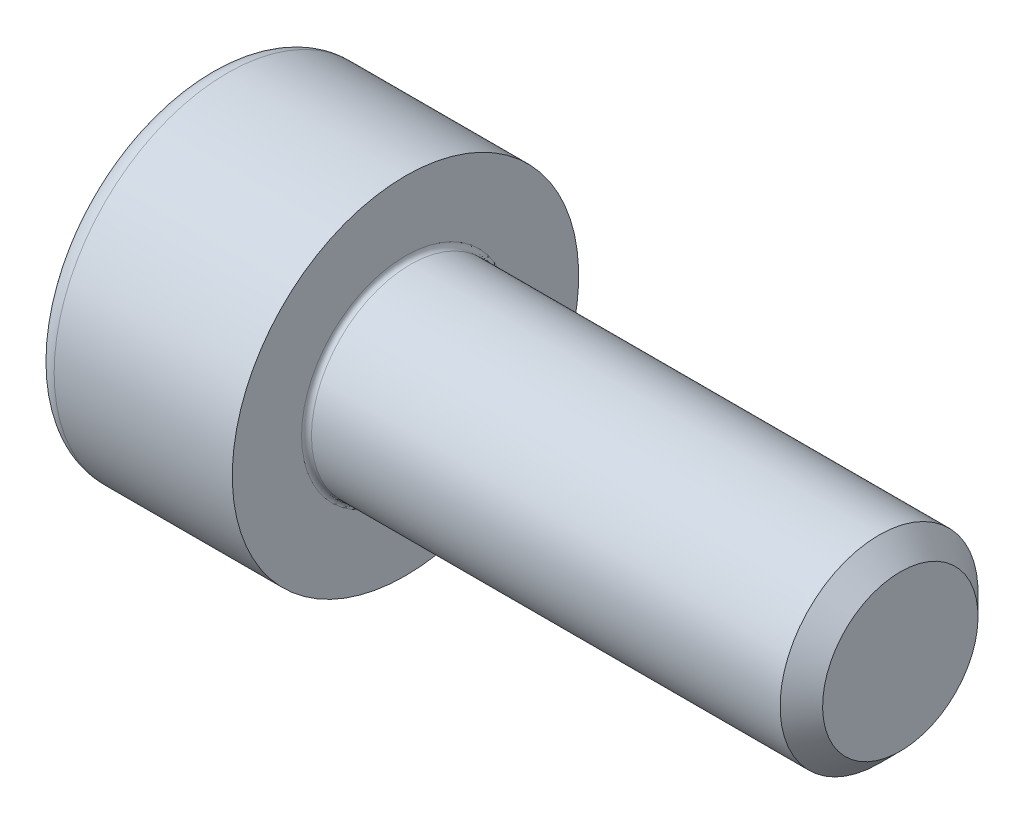
ISO-10303-21;
HEADER;
FILE_DESCRIPTION(('STEP AP214'),'2;1');
FILE_NAME('part.step','',(''),(''),'','','');
FILE_SCHEMA(('AUTOMOTIVE_DESIGN { 1 0 10303 214 1 1 1 1 }'));
ENDSEC;
DATA;
#1=APPLICATION_CONTEXT('core data for automotive mechanical design processes');
#2=APPLICATION_PROTOCOL_DEFINITION('international standard','automotive_design',2000,#1);
#3=PRODUCT_CONTEXT('',#1,'mechanical');
#4=PRODUCT('Part','Part','',(#3));
#5=PRODUCT_RELATED_PRODUCT_CATEGORY('part','',(#4));
#6=PRODUCT_DEFINITION_FORMATION('','',#4);
#7=PRODUCT_DEFINITION_CONTEXT('part definition',#1,'design');
#8=PRODUCT_DEFINITION('design','',#6,#7);
#9=PRODUCT_DEFINITION_SHAPE('','',#8);
#10=(LENGTH_UNIT() NAMED_UNIT(*) SI_UNIT(.MILLI.,.METRE.));
#11=(NAMED_UNIT(*) PLANE_ANGLE_UNIT() SI_UNIT($,.RADIAN.));
#12=(NAMED_UNIT(*) SI_UNIT($,.STERADIAN.) SOLID_ANGLE_UNIT());
#13=UNCERTAINTY_MEASURE_WITH_UNIT(LENGTH_MEASURE(1.E-05),#10,'distance_accuracy_value','');
#14=(GEOMETRIC_REPRESENTATION_CONTEXT(3) GLOBAL_UNCERTAINTY_ASSIGNED_CONTEXT((#13)) GLOBAL_UNIT_ASSIGNED_CONTEXT((#10,
#11,#12)) REPRESENTATION_CONTEXT('',''));
#15=CARTESIAN_POINT('',(0.,0.,0.));
#16=DIRECTION('',(0.,0.,1.));
#17=DIRECTION('',(1.,0.,0.));
#18=AXIS2_PLACEMENT_3D('',#15,#16,#17);
#19=CARTESIAN_POINT('',(-1.5,0.,0.));
#20=DIRECTION('',(-1.,0.,0.));
#21=DIRECTION('',(0.,1.,0.));
#22=AXIS2_PLACEMENT_3D('',#19,#20,#21);
#23=CONICAL_SURFACE('',#22,0.866025403784439,1.0471975511966);
#24=DIRECTION('',(-0.5,-0.866025403784439,0.));
#25=VECTOR('',#24,1.);
#26=CARTESIAN_POINT('',(-1.5,-0.866025403784439,0.));
#27=LINE('',#26,#25);
#28=CARTESIAN_POINT('',(-1.,0.,0.));
#29=VERTEX_POINT('',#28);
#30=CARTESIAN_POINT('',(-1.86602540378443,-1.5,0.));
#31=VERTEX_POINT('',#30);
#32=EDGE_CURVE('E12',#29,#31,#27,.T.);
#33=ORIENTED_EDGE('',*,*,#32,.T.);
#34=CARTESIAN_POINT('',(-1.86602540378443,-1.5,0.));
#35=CARTESIAN_POINT('',(-1.86602540378443,-1.5,0.401923788646684));
#36=CARTESIAN_POINT('',(-2.,-1.5,0.866025403784438));
#37=(BOUNDED_CURVE() B_SPLINE_CURVE(2,(#34,#35,#36),.UNSPECIFIED.,.F.,
.F.) B_SPLINE_CURVE_WITH_KNOTS((3,3),(0.0876327103558437,0.175265420711687),
.UNSPECIFIED.) CURVE() GEOMETRIC_REPRESENTATION_ITEM() RATIONAL_B_SPLINE_CURVE((1.07735026918962,
1.07735026918962,1.)) REPRESENTATION_ITEM(''));
#38=CARTESIAN_POINT('',(-2.,-1.5,0.866025403784438));
#39=VERTEX_POINT('',#38);
#40=EDGE_CURVE('E193',#31,#39,#37,.T.);
#41=ORIENTED_EDGE('',*,*,#40,.T.);
#42=CARTESIAN_POINT('',(-2.,-1.5,0.86602540378444));
#43=CARTESIAN_POINT('',(-1.75,-0.750000000000001,1.29903810567666));
#44=CARTESIAN_POINT('',(-2.,0.,1.73205080756888));
#45=(BOUNDED_CURVE() B_SPLINE_CURVE(2,(#42,#43,#44),.UNSPECIFIED.,.F.,
.F.) B_SPLINE_CURVE_WITH_KNOTS((3,3),(0.,0.175265420711687),
.UNSPECIFIED.) CURVE() GEOMETRIC_REPRESENTATION_ITEM() RATIONAL_B_SPLINE_CURVE((1.,
1.15470053837925,1.)) REPRESENTATION_ITEM(''));
#46=CARTESIAN_POINT('',(-2.,0.,1.73205080756888));
#47=VERTEX_POINT('',#46);
#48=EDGE_CURVE('E52',#39,#47,#45,.T.);
#49=ORIENTED_EDGE('',*,*,#48,.T.);
#50=CARTESIAN_POINT('',(-2.,0.,1.73205080756888));
#51=CARTESIAN_POINT('',(-1.74999999999999,0.750000000000001,1.29903810567666));
#52=CARTESIAN_POINT('',(-2.,1.5,0.866025403784438));
#53=(BOUNDED_CURVE() B_SPLINE_CURVE(2,(#50,#51,#52),.UNSPECIFIED.,.F.,
.F.) B_SPLINE_CURVE_WITH_KNOTS((3,3),(0.,0.175265420711688),
.UNSPECIFIED.) CURVE() GEOMETRIC_REPRESENTATION_ITEM() RATIONAL_B_SPLINE_CURVE((1.,
1.15470053837925,1.)) REPRESENTATION_ITEM(''));
#54=CARTESIAN_POINT('',(-2.,1.5,0.866025403784438));
#55=VERTEX_POINT('',#54);
#56=EDGE_CURVE('E183',#47,#55,#53,.T.);
#57=ORIENTED_EDGE('',*,*,#56,.T.);
#58=CARTESIAN_POINT('',(-2.,1.5,0.866025403784436));
#59=CARTESIAN_POINT('',(-1.75,1.5,0.));
#60=CARTESIAN_POINT('',(-2.,1.5,-0.866025403784437));
#61=(BOUNDED_CURVE() B_SPLINE_CURVE(2,(#58,#59,#60),.UNSPECIFIED.,.F.,
.F.) B_SPLINE_CURVE_WITH_KNOTS((3,3),(0.,0.175265420711687),
.UNSPECIFIED.) CURVE() GEOMETRIC_REPRESENTATION_ITEM() RATIONAL_B_SPLINE_CURVE((1.,
1.15470053837925,1.)) REPRESENTATION_ITEM(''));
#62=CARTESIAN_POINT('',(-2.,1.5,-0.866025403784439));
#63=VERTEX_POINT('',#62);
#64=EDGE_CURVE('E184',#55,#63,#61,.T.);
#65=ORIENTED_EDGE('',*,*,#64,.T.);
#66=CARTESIAN_POINT('',(-2.,1.5,-0.86602540378444));
#67=CARTESIAN_POINT('',(-1.75,0.750000000000001,-1.29903810567666));
#68=CARTESIAN_POINT('',(-2.,0.,-1.73205080756888));
#69=(BOUNDED_CURVE() B_SPLINE_CURVE(2,(#66,#67,#68),.UNSPECIFIED.,.F.,
.F.) B_SPLINE_CURVE_WITH_KNOTS((3,3),(0.,0.175265420711687),
.UNSPECIFIED.) CURVE() GEOMETRIC_REPRESENTATION_ITEM() RATIONAL_B_SPLINE_CURVE((1.,
1.15470053837925,1.)) REPRESENTATION_ITEM(''));
#70=CARTESIAN_POINT('',(-2.,0.,-1.73205080756888));
#71=VERTEX_POINT('',#70);
#72=EDGE_CURVE('E150',#63,#71,#69,.T.);
#73=ORIENTED_EDGE('',*,*,#72,.T.);
#74=CARTESIAN_POINT('',(-2.,0.,-1.73205080756888));
#75=CARTESIAN_POINT('',(-1.74999999999999,-0.750000000000001,-1.29903810567666));
#76=CARTESIAN_POINT('',(-2.,-1.5,-0.866025403784439));
#77=(BOUNDED_CURVE() B_SPLINE_CURVE(2,(#74,#75,#76),.UNSPECIFIED.,.F.,
.F.) B_SPLINE_CURVE_WITH_KNOTS((3,3),(0.,0.175265420711688),
.UNSPECIFIED.) CURVE() GEOMETRIC_REPRESENTATION_ITEM() RATIONAL_B_SPLINE_CURVE((1.,
1.15470053837925,1.)) REPRESENTATION_ITEM(''));
#78=CARTESIAN_POINT('',(-2.,-1.5,-0.866025403784438));
#79=VERTEX_POINT('',#78);
#80=EDGE_CURVE('E222',#71,#79,#77,.T.);
#81=ORIENTED_EDGE('',*,*,#80,.T.);
#82=CARTESIAN_POINT('',(-2.,-1.5,-0.866025403784437));
#83=CARTESIAN_POINT('',(-1.86602540378443,-1.5,-0.401923788646684));
#84=CARTESIAN_POINT('',(-1.86602540378443,-1.5,0.));
#85=(BOUNDED_CURVE() B_SPLINE_CURVE(2,(#82,#83,#84),.UNSPECIFIED.,.F.,
.F.) B_SPLINE_CURVE_WITH_KNOTS((3,3),(0.,0.0876327103558437),
.UNSPECIFIED.) CURVE() GEOMETRIC_REPRESENTATION_ITEM() RATIONAL_B_SPLINE_CURVE((1.,
1.07735026918962,1.07735026918962)) REPRESENTATION_ITEM(''));
#86=EDGE_CURVE('E146',#79,#31,#85,.T.);
#87=ORIENTED_EDGE('',*,*,#86,.T.);
#88=ORIENTED_EDGE('',*,*,#32,.F.);
#89=EDGE_LOOP('',(#33,#41,#49,#57,#65,#73,#81,#87,#88));
#90=FACE_BOUND('',#89,.T.);
#91=ADVANCED_FACE('F42',(#90),#23,.F.);
#92=CARTESIAN_POINT('',(-4.,-1.5,0.866025403784439));
#93=DIRECTION('',(0.,-0.5,0.866025403784439));
#94=DIRECTION('',(-1.,0.,0.));
#95=AXIS2_PLACEMENT_3D('',#92,#93,#94);
#96=PLANE('',#95);
#97=ORIENTED_EDGE('',*,*,#48,.F.);
#98=DIRECTION('',(-1.,0.,0.));
#99=VECTOR('',#98,1.);
#100=CARTESIAN_POINT('',(-3.,-1.5,0.866025403784438));
#101=LINE('',#100,#99);
#102=CARTESIAN_POINT('',(-4.,-1.5,0.866025403784439));
#103=VERTEX_POINT('',#102);
#104=EDGE_CURVE('E264',#39,#103,#101,.T.);
#105=ORIENTED_EDGE('',*,*,#104,.T.);
#106=DIRECTION('',(0.,-0.866025403784439,-0.5));
#107=VECTOR('',#106,1.);
#108=CARTESIAN_POINT('',(-4.,-1.125,1.08253175473055));
#109=LINE('',#108,#107);
#110=CARTESIAN_POINT('',(-4.,0.,1.73205080756888));
#111=VERTEX_POINT('',#110);
#112=EDGE_CURVE('E167',#111,#103,#109,.T.);
#113=ORIENTED_EDGE('',*,*,#112,.F.);
#114=DIRECTION('',(1.,0.,0.));
#115=VECTOR('',#114,1.);
#116=CARTESIAN_POINT('',(-3.,0.,1.73205080756888));
#117=LINE('',#116,#115);
#118=EDGE_CURVE('E194',#111,#47,#117,.T.);
#119=ORIENTED_EDGE('',*,*,#118,.T.);
#120=EDGE_LOOP('',(#97,#105,#113,#119));
#121=FACE_BOUND('',#120,.T.);
#122=ADVANCED_FACE('F324',(#121),#96,.F.);
#123=CARTESIAN_POINT('',(-4.,-1.5,-0.866025403784438));
#124=DIRECTION('',(0.,-1.,0.));
#125=DIRECTION('',(-1.,0.,0.));
#126=AXIS2_PLACEMENT_3D('',#123,#124,#125);
#127=PLANE('',#126);
#128=ORIENTED_EDGE('',*,*,#86,.F.);
#129=DIRECTION('',(-1.,0.,0.));
#130=VECTOR('',#129,1.);
#131=CARTESIAN_POINT('',(-3.,-1.5,-0.866025403784438));
#132=LINE('',#131,#130);
#133=CARTESIAN_POINT('',(-4.,-1.5,-0.866025403784438));
#134=VERTEX_POINT('',#133);
#135=EDGE_CURVE('E138',#79,#134,#132,.T.);
#136=ORIENTED_EDGE('',*,*,#135,.T.);
#137=DIRECTION('',(0.,0.,-1.));
#138=VECTOR('',#137,1.);
#139=CARTESIAN_POINT('',(-4.,-1.5,-0.433012701892219));
#140=LINE('',#139,#138);
#141=EDGE_CURVE('E143',#103,#134,#140,.T.);
#142=ORIENTED_EDGE('',*,*,#141,.F.);
#143=ORIENTED_EDGE('',*,*,#104,.F.);
#144=ORIENTED_EDGE('',*,*,#40,.F.);
#145=EDGE_LOOP('',(#128,#136,#142,#143,#144));
#146=FACE_BOUND('',#145,.T.);
#147=ADVANCED_FACE('F140',(#146),#127,.F.);
#148=CARTESIAN_POINT('',(-4.,0.,1.73205080756888));
#149=DIRECTION('',(0.,0.5,0.866025403784439));
#150=DIRECTION('',(1.,0.,0.));
#151=AXIS2_PLACEMENT_3D('',#148,#149,#150);
#152=PLANE('',#151);
#153=ORIENTED_EDGE('',*,*,#56,.F.);
#154=ORIENTED_EDGE('',*,*,#118,.F.);
#155=DIRECTION('',(0.,-0.866025403784439,0.5));
#156=VECTOR('',#155,1.);
#157=CARTESIAN_POINT('',(-4.,0.375,1.51554445662277));
#158=LINE('',#157,#156);
#159=CARTESIAN_POINT('',(-4.,1.5,0.866025403784438));
#160=VERTEX_POINT('',#159);
#161=EDGE_CURVE('E169',#160,#111,#158,.T.);
#162=ORIENTED_EDGE('',*,*,#161,.F.);
#163=DIRECTION('',(-1.,0.,0.));
#164=VECTOR('',#163,1.);
#165=CARTESIAN_POINT('',(-3.,1.5,0.866025403784438));
#166=LINE('',#165,#164);
#167=EDGE_CURVE('E180',#55,#160,#166,.T.);
#168=ORIENTED_EDGE('',*,*,#167,.F.);
#169=EDGE_LOOP('',(#153,#154,#162,#168));
#170=FACE_BOUND('',#169,.T.);
#171=ADVANCED_FACE('F340',(#170),#152,.F.);
#172=CARTESIAN_POINT('',(-4.,1.5,0.866025403784438));
#173=DIRECTION('',(0.,1.,0.));
#174=DIRECTION('',(0.,0.,-1.));
#175=AXIS2_PLACEMENT_3D('',#172,#173,#174);
#176=PLANE('',#175);
#177=ORIENTED_EDGE('',*,*,#64,.F.);
#178=ORIENTED_EDGE('',*,*,#167,.T.);
#179=DIRECTION('',(0.,0.,1.));
#180=VECTOR('',#179,1.);
#181=CARTESIAN_POINT('',(-4.,1.5,0.433012701892219));
#182=LINE('',#181,#180);
#183=CARTESIAN_POINT('',(-4.,1.5,-0.866025403784439));
#184=VERTEX_POINT('',#183);
#185=EDGE_CURVE('E257',#184,#160,#182,.T.);
#186=ORIENTED_EDGE('',*,*,#185,.F.);
#187=DIRECTION('',(-1.,0.,0.));
#188=VECTOR('',#187,1.);
#189=CARTESIAN_POINT('',(-3.,1.5,-0.866025403784439));
#190=LINE('',#189,#188);
#191=EDGE_CURVE('E173',#63,#184,#190,.T.);
#192=ORIENTED_EDGE('',*,*,#191,.F.);
#193=EDGE_LOOP('',(#177,#178,#186,#192));
#194=FACE_BOUND('',#193,.T.);
#195=ADVANCED_FACE('F336',(#194),#176,.F.);
#196=CARTESIAN_POINT('',(-4.,1.5,-0.866025403784439));
#197=DIRECTION('',(0.,0.5,-0.866025403784439));
#198=DIRECTION('',(-1.,0.,0.));
#199=AXIS2_PLACEMENT_3D('',#196,#197,#198);
#200=PLANE('',#199);
#201=ORIENTED_EDGE('',*,*,#72,.F.);
#202=ORIENTED_EDGE('',*,*,#191,.T.);
#203=DIRECTION('',(0.,0.866025403784439,0.5));
#204=VECTOR('',#203,1.);
#205=CARTESIAN_POINT('',(-4.,1.125,-1.08253175473055));
#206=LINE('',#205,#204);
#207=CARTESIAN_POINT('',(-4.,0.,-1.73205080756888));
#208=VERTEX_POINT('',#207);
#209=EDGE_CURVE('E160',#208,#184,#206,.T.);
#210=ORIENTED_EDGE('',*,*,#209,.F.);
#211=DIRECTION('',(-1.,0.,0.));
#212=VECTOR('',#211,1.);
#213=CARTESIAN_POINT('',(-3.,0.,-1.73205080756888));
#214=LINE('',#213,#212);
#215=EDGE_CURVE('E151',#71,#208,#214,.T.);
#216=ORIENTED_EDGE('',*,*,#215,.F.);
#217=EDGE_LOOP('',(#201,#202,#210,#216));
#218=FACE_BOUND('',#217,.T.);
#219=ADVANCED_FACE('F333',(#218),#200,.F.);
#220=CARTESIAN_POINT('',(-4.,0.,-1.73205080756888));
#221=DIRECTION('',(0.,-0.5,-0.866025403784439));
#222=DIRECTION('',(0.,-0.866025403784439,0.5));
#223=AXIS2_PLACEMENT_3D('',#220,#221,#222);
#224=PLANE('',#223);
#225=ORIENTED_EDGE('',*,*,#80,.F.);
#226=ORIENTED_EDGE('',*,*,#215,.T.);
#227=DIRECTION('',(0.,0.866025403784439,-0.5));
#228=VECTOR('',#227,1.);
#229=CARTESIAN_POINT('',(-4.,-0.375,-1.51554445662277));
#230=LINE('',#229,#228);
#231=EDGE_CURVE('E154',#134,#208,#230,.T.);
#232=ORIENTED_EDGE('',*,*,#231,.F.);
#233=ORIENTED_EDGE('',*,*,#135,.F.);
#234=EDGE_LOOP('',(#225,#226,#232,#233));
#235=FACE_BOUND('',#234,.T.);
#236=ADVANCED_FACE('F155',(#235),#224,.F.);
#237=CARTESIAN_POINT('',(-2.,0.,0.));
#238=DIRECTION('',(1.,0.,0.));
#239=DIRECTION('',(0.,1.,0.));
#240=AXIS2_PLACEMENT_3D('',#237,#238,#239);
#241=CYLINDRICAL_SURFACE('',#240,3.5);
#242=CARTESIAN_POINT('',(0.,0.,0.));
#243=DIRECTION('',(1.,0.,0.));
#244=DIRECTION('',(0.,1.,0.));
#245=AXIS2_PLACEMENT_3D('',#242,#243,#244);
#246=CIRCLE('',#245,3.5);
#247=CARTESIAN_POINT('',(0.,3.5,0.));
#248=VERTEX_POINT('',#247);
#249=CARTESIAN_POINT('',(0.,-3.5,0.));
#250=VERTEX_POINT('',#249);
#251=EDGE_CURVE('E218',#248,#250,#246,.T.);
#252=ORIENTED_EDGE('',*,*,#251,.F.);
#253=CARTESIAN_POINT('',(0.,0.,0.));
#254=DIRECTION('',(1.,0.,0.));
#255=DIRECTION('',(0.,1.,0.));
#256=AXIS2_PLACEMENT_3D('',#253,#254,#255);
#257=CIRCLE('',#256,3.5);
#258=EDGE_CURVE('E202',#250,#248,#257,.T.);
#259=ORIENTED_EDGE('',*,*,#258,.F.);
#260=DIRECTION('',(-1.,0.,0.));
#261=VECTOR('',#260,1.);
#262=CARTESIAN_POINT('',(-2.,-3.5,0.));
#263=LINE('',#262,#261);
#264=CARTESIAN_POINT('',(-3.6,-3.5,0.));
#265=VERTEX_POINT('',#264);
#266=EDGE_CURVE('E226',#250,#265,#263,.T.);
#267=ORIENTED_EDGE('',*,*,#266,.T.);
#268=CARTESIAN_POINT('',(-3.6,0.,0.));
#269=DIRECTION('',(-1.,0.,0.));
#270=DIRECTION('',(0.,-1.,0.));
#271=AXIS2_PLACEMENT_3D('',#268,#269,#270);
#272=CIRCLE('',#271,3.5);
#273=CARTESIAN_POINT('',(-3.6,3.5,0.));
#274=VERTEX_POINT('',#273);
#275=EDGE_CURVE('E179',#274,#265,#272,.T.);
#276=ORIENTED_EDGE('',*,*,#275,.F.);
#277=CARTESIAN_POINT('',(-3.6,0.,0.));
#278=DIRECTION('',(-1.,0.,0.));
#279=DIRECTION('',(0.,-1.,0.));
#280=AXIS2_PLACEMENT_3D('',#277,#278,#279);
#281=CIRCLE('',#280,3.5);
#282=CARTESIAN_POINT('',(-3.6,0.,3.5));
#283=VERTEX_POINT('',#282);
#284=EDGE_CURVE('E256',#283,#274,#281,.T.);
#285=ORIENTED_EDGE('',*,*,#284,.F.);
#286=CARTESIAN_POINT('',(-3.6,0.,0.));
#287=DIRECTION('',(-1.,0.,0.));
#288=DIRECTION('',(0.,-1.,0.));
#289=AXIS2_PLACEMENT_3D('',#286,#287,#288);
#290=CIRCLE('',#289,3.5);
#291=EDGE_CURVE('E175',#265,#283,#290,.T.);
#292=ORIENTED_EDGE('',*,*,#291,.F.);
#293=ORIENTED_EDGE('',*,*,#266,.F.);
#294=EDGE_LOOP('',(#252,#259,#267,#276,#285,#292,#293));
#295=FACE_BOUND('',#294,.T.);
#296=ADVANCED_FACE('F301',(#295),#241,.T.);
#297=CARTESIAN_POINT('',(-4.,2.61602540378444,0.));
#298=DIRECTION('',(-1.,0.,0.));
#299=DIRECTION('',(0.,1.,0.));
#300=AXIS2_PLACEMENT_3D('',#297,#298,#299);
#301=PLANE('',#300);
#302=ORIENTED_EDGE('',*,*,#185,.T.);
#303=ORIENTED_EDGE('',*,*,#161,.T.);
#304=ORIENTED_EDGE('',*,*,#112,.T.);
#305=ORIENTED_EDGE('',*,*,#141,.T.);
#306=ORIENTED_EDGE('',*,*,#231,.T.);
#307=ORIENTED_EDGE('',*,*,#209,.T.);
#308=EDGE_LOOP('',(#302,#303,#304,#305,#306,#307));
#309=FACE_BOUND('',#308,.T.);
#310=CARTESIAN_POINT('',(-4.,0.,0.));
#311=DIRECTION('',(1.,0.,0.));
#312=DIRECTION('',(0.,-1.,0.));
#313=AXIS2_PLACEMENT_3D('',#310,#311,#312);
#314=CIRCLE('',#313,3.1);
#315=CARTESIAN_POINT('',(-4.,3.1,0.));
#316=VERTEX_POINT('',#315);
#317=CARTESIAN_POINT('',(-4.,0.,3.1));
#318=VERTEX_POINT('',#317);
#319=EDGE_CURVE('E253',#316,#318,#314,.T.);
#320=ORIENTED_EDGE('',*,*,#319,.F.);
#321=CARTESIAN_POINT('',(-4.,0.,0.));
#322=DIRECTION('',(1.,0.,0.));
#323=DIRECTION('',(0.,-1.,0.));
#324=AXIS2_PLACEMENT_3D('',#321,#322,#323);
#325=CIRCLE('',#324,3.1);
#326=EDGE_CURVE('E216',#318,#316,#325,.T.);
#327=ORIENTED_EDGE('',*,*,#326,.F.);
#328=EDGE_LOOP('',(#320,#327));
#329=FACE_BOUND('',#328,.T.);
#330=ADVANCED_FACE('F163',(#309,#329),#301,.T.);
#331=CARTESIAN_POINT('',(-3.6,0.,0.));
#332=DIRECTION('',(1.,0.,0.));
#333=DIRECTION('',(0.,0.,-1.));
#334=AXIS2_PLACEMENT_3D('',#331,#332,#333);
#335=TOROIDAL_SURFACE('',#334,3.1,0.4);
#336=ORIENTED_EDGE('',*,*,#275,.T.);
#337=ORIENTED_EDGE('',*,*,#291,.T.);
#338=CARTESIAN_POINT('',(-3.6,0.,3.1));
#339=DIRECTION('',(0.,-1.,0.));
#340=DIRECTION('',(0.,0.,1.));
#341=AXIS2_PLACEMENT_3D('',#338,#339,#340);
#342=CIRCLE('',#341,0.4);
#343=EDGE_CURVE('E178',#283,#318,#342,.T.);
#344=ORIENTED_EDGE('',*,*,#343,.T.);
#345=ORIENTED_EDGE('',*,*,#326,.T.);
#346=ORIENTED_EDGE('',*,*,#319,.T.);
#347=ORIENTED_EDGE('',*,*,#343,.F.);
#348=ORIENTED_EDGE('',*,*,#284,.T.);
#349=EDGE_LOOP('',(#336,#337,#344,#345,#346,#347,#348));
#350=FACE_BOUND('',#349,.T.);
#351=ADVANCED_FACE('F307',(#350),#335,.T.);
#352=CARTESIAN_POINT('',(10.,1.,0.));
#353=DIRECTION('',(1.,0.,0.));
#354=DIRECTION('',(0.,1.,0.));
#355=AXIS2_PLACEMENT_3D('',#352,#353,#354);
#356=PLANE('',#355);
#357=CARTESIAN_POINT('',(10.,0.,0.));
#358=DIRECTION('',(-1.,0.,0.));
#359=DIRECTION('',(0.,-1.,0.));
#360=AXIS2_PLACEMENT_3D('',#357,#358,#359);
#361=CIRCLE('',#360,1.570585);
#362=CARTESIAN_POINT('',(10.,1.570585,0.));
#363=VERTEX_POINT('',#362);
#364=EDGE_CURVE('E200',#363,#363,#361,.T.);
#365=ORIENTED_EDGE('',*,*,#364,.F.);
#366=EDGE_LOOP('',(#365));
#367=FACE_BOUND('',#366,.T.);
#368=ADVANCED_FACE('F317',(#367),#356,.T.);
#369=CARTESIAN_POINT('',(9.7852925,0.,0.));
#370=DIRECTION('',(-1.,0.,0.));
#371=DIRECTION('',(0.,-1.,0.));
#372=AXIS2_PLACEMENT_3D('',#369,#370,#371);
#373=CONICAL_SURFACE('',#372,1.7852925,0.785398163397448);
#374=ORIENTED_EDGE('',*,*,#364,.T.);
#375=DIRECTION('',(-0.707106781186548,0.707106781186548,0.));
#376=VECTOR('',#375,1.);
#377=CARTESIAN_POINT('',(9.7852925,1.7852925,0.));
#378=LINE('',#377,#376);
#379=CARTESIAN_POINT('',(9.570585,2.,0.));
#380=VERTEX_POINT('',#379);
#381=EDGE_CURVE('E94',#363,#380,#378,.T.);
#382=ORIENTED_EDGE('',*,*,#381,.T.);
#383=CARTESIAN_POINT('',(9.570585,0.,0.));
#384=DIRECTION('',(1.,0.,0.));
#385=DIRECTION('',(0.,-1.,0.));
#386=AXIS2_PLACEMENT_3D('',#383,#384,#385);
#387=CIRCLE('',#386,2.);
#388=CARTESIAN_POINT('',(9.570585,-2.,0.));
#389=VERTEX_POINT('',#388);
#390=EDGE_CURVE('E203',#380,#389,#387,.T.);
#391=ORIENTED_EDGE('',*,*,#390,.T.);
#392=CARTESIAN_POINT('',(9.570585,0.,0.));
#393=DIRECTION('',(1.,0.,0.));
#394=DIRECTION('',(0.,-1.,0.));
#395=AXIS2_PLACEMENT_3D('',#392,#393,#394);
#396=CIRCLE('',#395,2.);
#397=EDGE_CURVE('E46',#389,#380,#396,.T.);
#398=ORIENTED_EDGE('',*,*,#397,.T.);
#399=ORIENTED_EDGE('',*,*,#381,.F.);
#400=EDGE_LOOP('',(#374,#382,#391,#398,#399));
#401=FACE_BOUND('',#400,.T.);
#402=ADVANCED_FACE('F44',(#401),#373,.T.);
#403=CARTESIAN_POINT('',(0.,2.75,0.));
#404=DIRECTION('',(1.,0.,0.));
#405=DIRECTION('',(0.,1.,0.));
#406=AXIS2_PLACEMENT_3D('',#403,#404,#405);
#407=PLANE('',#406);
#408=CARTESIAN_POINT('',(0.,0.,0.));
#409=DIRECTION('',(1.,0.,0.));
#410=DIRECTION('',(0.,-1.,0.));
#411=AXIS2_PLACEMENT_3D('',#408,#409,#410);
#412=CIRCLE('',#411,2.1);
#413=CARTESIAN_POINT('',(0.,2.1,0.));
#414=VERTEX_POINT('',#413);
#415=CARTESIAN_POINT('',(0.,0.,2.1));
#416=VERTEX_POINT('',#415);
#417=EDGE_CURVE('E234',#414,#416,#412,.T.);
#418=ORIENTED_EDGE('',*,*,#417,.F.);
#419=CARTESIAN_POINT('',(0.,0.,0.));
#420=DIRECTION('',(1.,0.,0.));
#421=DIRECTION('',(0.,-1.,0.));
#422=AXIS2_PLACEMENT_3D('',#419,#420,#421);
#423=CIRCLE('',#422,2.1);
#424=EDGE_CURVE('E204',#416,#414,#423,.T.);
#425=ORIENTED_EDGE('',*,*,#424,.F.);
#426=EDGE_LOOP('',(#418,#425));
#427=FACE_BOUND('',#426,.T.);
#428=ORIENTED_EDGE('',*,*,#251,.T.);
#429=ORIENTED_EDGE('',*,*,#258,.T.);
#430=EDGE_LOOP('',(#428,#429));
#431=FACE_BOUND('',#430,.T.);
#432=ADVANCED_FACE('F294',(#427,#431),#407,.T.);
#433=CARTESIAN_POINT('',(33.,0.,0.));
#434=DIRECTION('',(1.,0.,0.));
#435=DIRECTION('',(0.,1.,0.));
#436=AXIS2_PLACEMENT_3D('',#433,#434,#435);
#437=CYLINDRICAL_SURFACE('',#436,2.);
#438=ORIENTED_EDGE('',*,*,#390,.F.);
#439=ORIENTED_EDGE('',*,*,#397,.F.);
#440=DIRECTION('',(-1.,0.,0.));
#441=VECTOR('',#440,1.);
#442=CARTESIAN_POINT('',(33.,-2.,0.));
#443=LINE('',#442,#441);
#444=CARTESIAN_POINT('',(0.100000000000002,-2.,0.));
#445=VERTEX_POINT('',#444);
#446=EDGE_CURVE('E102',#389,#445,#443,.T.);
#447=ORIENTED_EDGE('',*,*,#446,.T.);
#448=CARTESIAN_POINT('',(0.100000000000002,0.,0.));
#449=DIRECTION('',(-1.,0.,0.));
#450=DIRECTION('',(0.,-1.,0.));
#451=AXIS2_PLACEMENT_3D('',#448,#449,#450);
#452=CIRCLE('',#451,2.);
#453=CARTESIAN_POINT('',(0.100000000000002,2.,0.));
#454=VERTEX_POINT('',#453);
#455=EDGE_CURVE('E188',#454,#445,#452,.T.);
#456=ORIENTED_EDGE('',*,*,#455,.F.);
#457=CARTESIAN_POINT('',(0.100000000000002,0.,0.));
#458=DIRECTION('',(-1.,0.,0.));
#459=DIRECTION('',(0.,-1.,0.));
#460=AXIS2_PLACEMENT_3D('',#457,#458,#459);
#461=CIRCLE('',#460,2.);
#462=CARTESIAN_POINT('',(0.100000000000002,0.,2.));
#463=VERTEX_POINT('',#462);
#464=EDGE_CURVE('E185',#463,#454,#461,.T.);
#465=ORIENTED_EDGE('',*,*,#464,.F.);
#466=CARTESIAN_POINT('',(0.100000000000002,0.,0.));
#467=DIRECTION('',(-1.,0.,0.));
#468=DIRECTION('',(0.,-1.,0.));
#469=AXIS2_PLACEMENT_3D('',#466,#467,#468);
#470=CIRCLE('',#469,2.);
#471=EDGE_CURVE('E206',#445,#463,#470,.T.);
#472=ORIENTED_EDGE('',*,*,#471,.F.);
#473=ORIENTED_EDGE('',*,*,#446,.F.);
#474=EDGE_LOOP('',(#438,#439,#447,#456,#465,#472,#473));
#475=FACE_BOUND('',#474,.T.);
#476=ADVANCED_FACE('F246',(#475),#437,.T.);
#477=CARTESIAN_POINT('',(0.100000000000002,0.,0.));
#478=DIRECTION('',(1.,0.,0.));
#479=DIRECTION('',(0.,0.,-1.));
#480=AXIS2_PLACEMENT_3D('',#477,#478,#479);
#481=TOROIDAL_SURFACE('',#480,2.1,0.1);
#482=ORIENTED_EDGE('',*,*,#417,.T.);
#483=CARTESIAN_POINT('',(0.100000000000002,0.,2.1));
#484=DIRECTION('',(0.,-1.,0.));
#485=DIRECTION('',(0.,0.,1.));
#486=AXIS2_PLACEMENT_3D('',#483,#484,#485);
#487=CIRCLE('',#486,0.1);
#488=EDGE_CURVE('E189',#416,#463,#487,.T.);
#489=ORIENTED_EDGE('',*,*,#488,.T.);
#490=ORIENTED_EDGE('',*,*,#464,.T.);
#491=ORIENTED_EDGE('',*,*,#455,.T.);
#492=ORIENTED_EDGE('',*,*,#471,.T.);
#493=ORIENTED_EDGE('',*,*,#488,.F.);
#494=ORIENTED_EDGE('',*,*,#424,.T.);
#495=EDGE_LOOP('',(#482,#489,#490,#491,#492,#493,#494));
#496=FACE_BOUND('',#495,.T.);
#497=ADVANCED_FACE('F243',(#496),#481,.F.);
#498=CLOSED_SHELL('',(#91,#122,#147,#171,#195,#219,#236,#296,#330,#351,#368,#402,#432,#476,#497));
#499=MANIFOLD_SOLID_BREP('B2',#498);
#500=ADVANCED_BREP_SHAPE_REPRESENTATION('',(#18,#499),#14);
#501=SHAPE_DEFINITION_REPRESENTATION(#9,#500);
ENDSEC;
END-ISO-10303-21;
